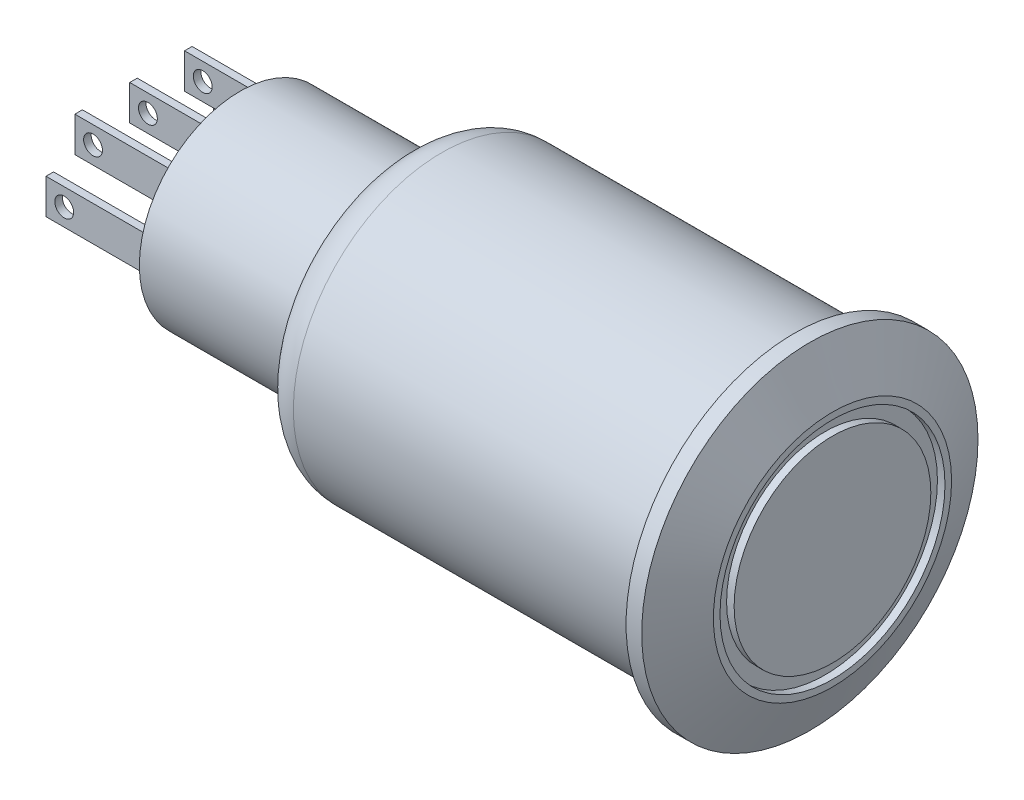
ISO-10303-21;
HEADER;
FILE_DESCRIPTION(('STEP AP214'),'2;1');
FILE_NAME('part.step','',(''),(''),'','','');
FILE_SCHEMA(('AUTOMOTIVE_DESIGN { 1 0 10303 214 1 1 1 1 }'));
ENDSEC;
DATA;
#1=APPLICATION_CONTEXT('core data for automotive mechanical design processes');
#2=APPLICATION_PROTOCOL_DEFINITION('international standard','automotive_design',2000,#1);
#3=PRODUCT_CONTEXT('',#1,'mechanical');
#4=PRODUCT('Part','Part','',(#3));
#5=PRODUCT_RELATED_PRODUCT_CATEGORY('part','',(#4));
#6=PRODUCT_DEFINITION_FORMATION('','',#4);
#7=PRODUCT_DEFINITION_CONTEXT('part definition',#1,'design');
#8=PRODUCT_DEFINITION('design','',#6,#7);
#9=PRODUCT_DEFINITION_SHAPE('','',#8);
#10=(LENGTH_UNIT() NAMED_UNIT(*) SI_UNIT(.MILLI.,.METRE.));
#11=(NAMED_UNIT(*) PLANE_ANGLE_UNIT() SI_UNIT($,.RADIAN.));
#12=(NAMED_UNIT(*) SI_UNIT($,.STERADIAN.) SOLID_ANGLE_UNIT());
#13=UNCERTAINTY_MEASURE_WITH_UNIT(LENGTH_MEASURE(1.E-05),#10,'distance_accuracy_value','');
#14=(GEOMETRIC_REPRESENTATION_CONTEXT(3) GLOBAL_UNCERTAINTY_ASSIGNED_CONTEXT((#13)) GLOBAL_UNIT_ASSIGNED_CONTEXT((#10,
#11,#12)) REPRESENTATION_CONTEXT('',''));
#15=CARTESIAN_POINT('',(0.,0.,0.));
#16=DIRECTION('',(0.,0.,1.));
#17=DIRECTION('',(1.,0.,0.));
#18=AXIS2_PLACEMENT_3D('',#15,#16,#17);
#19=CARTESIAN_POINT('',(-8.7,0.,0.));
#20=DIRECTION('',(-1.,0.,0.));
#21=DIRECTION('',(0.,0.,1.));
#22=AXIS2_PLACEMENT_3D('',#19,#20,#21);
#23=PLANE('',#22);
#24=CARTESIAN_POINT('',(-8.7,0.,0.));
#25=DIRECTION('',(-1.,0.,0.));
#26=DIRECTION('',(0.,0.,1.));
#27=AXIS2_PLACEMENT_3D('',#24,#25,#26);
#28=CIRCLE('',#27,5.34);
#29=CARTESIAN_POINT('',(-8.7,0.,5.34));
#30=VERTEX_POINT('',#29);
#31=EDGE_CURVE('E314',#30,#30,#28,.T.);
#32=ORIENTED_EDGE('',*,*,#31,.T.);
#33=EDGE_LOOP('',(#32));
#34=FACE_BOUND('',#33,.T.);
#35=DIRECTION('',(0.,0.,-1.));
#36=VECTOR('',#35,1.);
#37=CARTESIAN_POINT('',(-8.7,3.01596308984255,-3.10816810993934));
#38=LINE('',#37,#36);
#39=CARTESIAN_POINT('',(-8.7,3.01596308984255,-2.70816810993934));
#40=VERTEX_POINT('',#39);
#41=CARTESIAN_POINT('',(-8.7,3.01596308984255,-3.10816810993934));
#42=VERTEX_POINT('',#41);
#43=EDGE_CURVE('E299',#40,#42,#38,.T.);
#44=ORIENTED_EDGE('',*,*,#43,.F.);
#45=DIRECTION('',(0.,1.,0.));
#46=VECTOR('',#45,1.);
#47=CARTESIAN_POINT('',(-8.7,3.01596308984255,-2.70816810993934));
#48=LINE('',#47,#46);
#49=CARTESIAN_POINT('',(-8.7,1.15596308984255,-2.70816810993934));
#50=VERTEX_POINT('',#49);
#51=EDGE_CURVE('E285',#50,#40,#48,.T.);
#52=ORIENTED_EDGE('',*,*,#51,.F.);
#53=DIRECTION('',(0.,0.,1.));
#54=VECTOR('',#53,1.);
#55=CARTESIAN_POINT('',(-8.7,1.15596308984255,-3.10816810993934));
#56=LINE('',#55,#54);
#57=CARTESIAN_POINT('',(-8.7,1.15596308984255,-3.10816810993934));
#58=VERTEX_POINT('',#57);
#59=EDGE_CURVE('E290',#58,#50,#56,.T.);
#60=ORIENTED_EDGE('',*,*,#59,.F.);
#61=DIRECTION('',(0.,-1.,0.));
#62=VECTOR('',#61,1.);
#63=CARTESIAN_POINT('',(-8.7,3.01596308984255,-3.10816810993934));
#64=LINE('',#63,#62);
#65=EDGE_CURVE('E301',#42,#58,#64,.T.);
#66=ORIENTED_EDGE('',*,*,#65,.F.);
#67=EDGE_LOOP('',(#44,#52,#60,#66));
#68=FACE_BOUND('',#67,.T.);
#69=DIRECTION('',(0.,0.,1.));
#70=VECTOR('',#69,1.);
#71=CARTESIAN_POINT('',(-8.7,1.15596308984255,0.2));
#72=LINE('',#71,#70);
#73=CARTESIAN_POINT('',(-8.7,1.15596308984255,-0.2));
#74=VERTEX_POINT('',#73);
#75=CARTESIAN_POINT('',(-8.7,1.15596308984255,0.2));
#76=VERTEX_POINT('',#75);
#77=EDGE_CURVE('E270',#74,#76,#72,.T.);
#78=ORIENTED_EDGE('',*,*,#77,.F.);
#79=DIRECTION('',(0.,-1.,0.));
#80=VECTOR('',#79,1.);
#81=CARTESIAN_POINT('',(-8.7,1.15596308984255,-0.2));
#82=LINE('',#81,#80);
#83=CARTESIAN_POINT('',(-8.7,3.01596308984255,-0.2));
#84=VERTEX_POINT('',#83);
#85=EDGE_CURVE('E256',#84,#74,#82,.T.);
#86=ORIENTED_EDGE('',*,*,#85,.F.);
#87=DIRECTION('',(0.,0.,-1.));
#88=VECTOR('',#87,1.);
#89=CARTESIAN_POINT('',(-8.7,3.01596308984255,0.2));
#90=LINE('',#89,#88);
#91=CARTESIAN_POINT('',(-8.7,3.01596308984255,0.2));
#92=VERTEX_POINT('',#91);
#93=EDGE_CURVE('E261',#92,#84,#90,.T.);
#94=ORIENTED_EDGE('',*,*,#93,.F.);
#95=DIRECTION('',(0.,1.,0.));
#96=VECTOR('',#95,1.);
#97=CARTESIAN_POINT('',(-8.7,1.15596308984255,0.2));
#98=LINE('',#97,#96);
#99=EDGE_CURVE('E272',#76,#92,#98,.T.);
#100=ORIENTED_EDGE('',*,*,#99,.F.);
#101=EDGE_LOOP('',(#78,#86,#94,#100));
#102=FACE_BOUND('',#101,.T.);
#103=DIRECTION('',(0.,0.,-1.));
#104=VECTOR('',#103,1.);
#105=CARTESIAN_POINT('',(-8.7,3.01596308984255,3.10816810993934));
#106=LINE('',#105,#104);
#107=CARTESIAN_POINT('',(-8.7,3.01596308984255,3.10816810993934));
#108=VERTEX_POINT('',#107);
#109=CARTESIAN_POINT('',(-8.7,3.01596308984255,2.70816810993934));
#110=VERTEX_POINT('',#109);
#111=EDGE_CURVE('E241',#108,#110,#106,.T.);
#112=ORIENTED_EDGE('',*,*,#111,.F.);
#113=DIRECTION('',(0.,1.,0.));
#114=VECTOR('',#113,1.);
#115=CARTESIAN_POINT('',(-8.7,3.01596308984255,3.10816810993934));
#116=LINE('',#115,#114);
#117=CARTESIAN_POINT('',(-8.7,1.15596308984255,3.10816810993934));
#118=VERTEX_POINT('',#117);
#119=EDGE_CURVE('E227',#118,#108,#116,.T.);
#120=ORIENTED_EDGE('',*,*,#119,.F.);
#121=DIRECTION('',(0.,0.,1.));
#122=VECTOR('',#121,1.);
#123=CARTESIAN_POINT('',(-8.7,1.15596308984255,3.10816810993934));
#124=LINE('',#123,#122);
#125=CARTESIAN_POINT('',(-8.7,1.15596308984255,2.70816810993934));
#126=VERTEX_POINT('',#125);
#127=EDGE_CURVE('E232',#126,#118,#124,.T.);
#128=ORIENTED_EDGE('',*,*,#127,.F.);
#129=DIRECTION('',(0.,-1.,0.));
#130=VECTOR('',#129,1.);
#131=CARTESIAN_POINT('',(-8.7,3.01596308984255,2.70816810993934));
#132=LINE('',#131,#130);
#133=EDGE_CURVE('E243',#110,#126,#132,.T.);
#134=ORIENTED_EDGE('',*,*,#133,.F.);
#135=EDGE_LOOP('',(#112,#120,#128,#134));
#136=FACE_BOUND('',#135,.T.);
#137=DIRECTION('',(0.,0.,-1.));
#138=VECTOR('',#137,1.);
#139=CARTESIAN_POINT('',(-8.7,0.930000000000001,-4.63786569712756));
#140=LINE('',#139,#138);
#141=CARTESIAN_POINT('',(-8.7,0.930000000000001,-4.23786569712756));
#142=VERTEX_POINT('',#141);
#143=CARTESIAN_POINT('',(-8.7,0.930000000000001,-4.63786569712756));
#144=VERTEX_POINT('',#143);
#145=EDGE_CURVE('E199',#142,#144,#140,.T.);
#146=ORIENTED_EDGE('',*,*,#145,.F.);
#147=DIRECTION('',(0.,1.,0.));
#148=VECTOR('',#147,1.);
#149=CARTESIAN_POINT('',(-8.7,0.930000000000001,-4.23786569712756));
#150=LINE('',#149,#148);
#151=CARTESIAN_POINT('',(-8.7,-0.929999999999999,-4.23786569712756));
#152=VERTEX_POINT('',#151);
#153=EDGE_CURVE('E196',#152,#142,#150,.T.);
#154=ORIENTED_EDGE('',*,*,#153,.F.);
#155=DIRECTION('',(0.,0.,1.));
#156=VECTOR('',#155,1.);
#157=CARTESIAN_POINT('',(-8.7,-0.929999999999999,-4.63786569712756));
#158=LINE('',#157,#156);
#159=CARTESIAN_POINT('',(-8.7,-0.929999999999999,-4.63786569712756));
#160=VERTEX_POINT('',#159);
#161=EDGE_CURVE('E208',#160,#152,#158,.T.);
#162=ORIENTED_EDGE('',*,*,#161,.F.);
#163=DIRECTION('',(0.,-1.,0.));
#164=VECTOR('',#163,1.);
#165=CARTESIAN_POINT('',(-8.7,0.930000000000001,-4.63786569712756));
#166=LINE('',#165,#164);
#167=EDGE_CURVE('E216',#144,#160,#166,.T.);
#168=ORIENTED_EDGE('',*,*,#167,.F.);
#169=EDGE_LOOP('',(#146,#154,#162,#168));
#170=FACE_BOUND('',#169,.T.);
#171=DIRECTION('',(0.,0.,-1.));
#172=VECTOR('',#171,1.);
#173=CARTESIAN_POINT('',(-8.7,0.930000000000001,4.63786569712756));
#174=LINE('',#173,#172);
#175=CARTESIAN_POINT('',(-8.7,0.930000000000001,4.63786569712756));
#176=VERTEX_POINT('',#175);
#177=CARTESIAN_POINT('',(-8.7,0.930000000000001,4.23786569712756));
#178=VERTEX_POINT('',#177);
#179=EDGE_CURVE('E809',#176,#178,#174,.T.);
#180=ORIENTED_EDGE('',*,*,#179,.F.);
#181=DIRECTION('',(0.,1.,0.));
#182=VECTOR('',#181,1.);
#183=CARTESIAN_POINT('',(-8.7,0.930000000000001,4.63786569712756));
#184=LINE('',#183,#182);
#185=CARTESIAN_POINT('',(-8.7,-0.929999999999999,4.63786569712756));
#186=VERTEX_POINT('',#185);
#187=EDGE_CURVE('E194',#186,#176,#184,.T.);
#188=ORIENTED_EDGE('',*,*,#187,.F.);
#189=DIRECTION('',(0.,0.,1.));
#190=VECTOR('',#189,1.);
#191=CARTESIAN_POINT('',(-8.7,-0.929999999999999,4.63786569712756));
#192=LINE('',#191,#190);
#193=CARTESIAN_POINT('',(-8.7,-0.929999999999999,4.23786569712756));
#194=VERTEX_POINT('',#193);
#195=EDGE_CURVE('E190',#194,#186,#192,.T.);
#196=ORIENTED_EDGE('',*,*,#195,.F.);
#197=DIRECTION('',(0.,-1.,0.));
#198=VECTOR('',#197,1.);
#199=CARTESIAN_POINT('',(-8.7,0.930000000000001,4.23786569712756));
#200=LINE('',#199,#198);
#201=EDGE_CURVE('E811',#178,#194,#200,.T.);
#202=ORIENTED_EDGE('',*,*,#201,.F.);
#203=EDGE_LOOP('',(#180,#188,#196,#202));
#204=FACE_BOUND('',#203,.T.);
#205=ADVANCED_FACE('F33',(#34,#68,#102,#136,#170,#204),#23,.T.);
#206=CARTESIAN_POINT('',(20.68,0.,0.));
#207=DIRECTION('',(-1.,0.,0.));
#208=DIRECTION('',(0.,0.,1.));
#209=AXIS2_PLACEMENT_3D('',#206,#207,#208);
#210=CYLINDRICAL_SURFACE('',#209,7.875);
#211=CARTESIAN_POINT('',(2.,0.,0.));
#212=DIRECTION('',(1.,0.,0.));
#213=DIRECTION('',(0.,0.,-1.));
#214=AXIS2_PLACEMENT_3D('',#211,#212,#213);
#215=CIRCLE('',#214,7.875);
#216=CARTESIAN_POINT('',(2.,0.,-7.875));
#217=VERTEX_POINT('',#216);
#218=EDGE_CURVE('E41',#217,#217,#215,.T.);
#219=ORIENTED_EDGE('',*,*,#218,.T.);
#220=EDGE_LOOP('',(#219));
#221=FACE_BOUND('',#220,.T.);
#222=CARTESIAN_POINT('',(20.68,0.,0.));
#223=DIRECTION('',(1.,0.,0.));
#224=DIRECTION('',(0.,0.,-1.));
#225=AXIS2_PLACEMENT_3D('',#222,#223,#224);
#226=CIRCLE('',#225,7.875);
#227=CARTESIAN_POINT('',(20.68,0.,-7.875));
#228=VERTEX_POINT('',#227);
#229=EDGE_CURVE('E336',#228,#228,#226,.T.);
#230=ORIENTED_EDGE('',*,*,#229,.F.);
#231=EDGE_LOOP('',(#230));
#232=FACE_BOUND('',#231,.T.);
#233=ADVANCED_FACE('F356',(#221,#232),#210,.T.);
#234=CARTESIAN_POINT('',(0.,0.,0.));
#235=DIRECTION('',(1.,0.,0.));
#236=DIRECTION('',(0.,0.,-1.));
#237=AXIS2_PLACEMENT_3D('',#234,#235,#236);
#238=PLANE('',#237);
#239=CARTESIAN_POINT('',(0.,0.,0.));
#240=DIRECTION('',(1.,0.,0.));
#241=DIRECTION('',(0.,0.,-1.));
#242=AXIS2_PLACEMENT_3D('',#239,#240,#241);
#243=CIRCLE('',#242,5.875);
#244=CARTESIAN_POINT('',(0.,0.,-5.875));
#245=VERTEX_POINT('',#244);
#246=EDGE_CURVE('E11',#245,#245,#243,.F.);
#247=ORIENTED_EDGE('',*,*,#246,.T.);
#248=EDGE_LOOP('',(#247));
#249=FACE_BOUND('',#248,.T.);
#250=CARTESIAN_POINT('',(0.,0.,0.));
#251=DIRECTION('',(-1.,0.,0.));
#252=DIRECTION('',(0.,0.,1.));
#253=AXIS2_PLACEMENT_3D('',#250,#251,#252);
#254=CIRCLE('',#253,5.34);
#255=CARTESIAN_POINT('',(0.,0.,5.34));
#256=VERTEX_POINT('',#255);
#257=EDGE_CURVE('E318',#256,#256,#254,.T.);
#258=ORIENTED_EDGE('',*,*,#257,.F.);
#259=EDGE_LOOP('',(#258));
#260=FACE_BOUND('',#259,.T.);
#261=ADVANCED_FACE('F376',(#249,#260),#238,.F.);
#262=CARTESIAN_POINT('',(22.71,0.,0.));
#263=DIRECTION('',(-1.,0.,0.));
#264=DIRECTION('',(0.,0.,1.));
#265=AXIS2_PLACEMENT_3D('',#262,#263,#264);
#266=CYLINDRICAL_SURFACE('',#265,8.915);
#267=CARTESIAN_POINT('',(21.51,0.,0.));
#268=DIRECTION('',(1.,0.,0.));
#269=DIRECTION('',(0.,0.,-1.));
#270=AXIS2_PLACEMENT_3D('',#267,#268,#269);
#271=CIRCLE('',#270,8.915);
#272=CARTESIAN_POINT('',(21.51,0.,-8.915));
#273=VERTEX_POINT('',#272);
#274=EDGE_CURVE('E321',#273,#273,#271,.F.);
#275=ORIENTED_EDGE('',*,*,#274,.T.);
#276=EDGE_LOOP('',(#275));
#277=FACE_BOUND('',#276,.T.);
#278=CARTESIAN_POINT('',(20.68,0.,0.));
#279=DIRECTION('',(1.,0.,0.));
#280=DIRECTION('',(0.,0.,-1.));
#281=AXIS2_PLACEMENT_3D('',#278,#279,#280);
#282=CIRCLE('',#281,8.915);
#283=CARTESIAN_POINT('',(20.68,0.,-8.915));
#284=VERTEX_POINT('',#283);
#285=EDGE_CURVE('E331',#284,#284,#282,.T.);
#286=ORIENTED_EDGE('',*,*,#285,.T.);
#287=EDGE_LOOP('',(#286));
#288=FACE_BOUND('',#287,.T.);
#289=ADVANCED_FACE('F405',(#277,#288),#266,.T.);
#290=CARTESIAN_POINT('',(22.71,0.,0.));
#291=DIRECTION('',(1.,0.,0.));
#292=DIRECTION('',(0.,0.,-1.));
#293=AXIS2_PLACEMENT_3D('',#290,#291,#292);
#294=PLANE('',#293);
#295=CARTESIAN_POINT('',(22.71,0.,0.));
#296=DIRECTION('',(1.,0.,0.));
#297=DIRECTION('',(0.,0.,-1.));
#298=AXIS2_PLACEMENT_3D('',#295,#296,#297);
#299=CIRCLE('',#298,6.31499999999998);
#300=CARTESIAN_POINT('',(22.71,0.,-6.31499999999998));
#301=VERTEX_POINT('',#300);
#302=EDGE_CURVE('E339',#301,#301,#299,.T.);
#303=ORIENTED_EDGE('',*,*,#302,.T.);
#304=EDGE_LOOP('',(#303));
#305=FACE_BOUND('',#304,.T.);
#306=CARTESIAN_POINT('',(22.71,0.,0.));
#307=DIRECTION('',(1.,0.,0.));
#308=DIRECTION('',(0.,0.,-1.));
#309=AXIS2_PLACEMENT_3D('',#306,#307,#308);
#310=CIRCLE('',#309,5.965);
#311=CARTESIAN_POINT('',(22.71,0.,-5.965));
#312=VERTEX_POINT('',#311);
#313=EDGE_CURVE('E325',#312,#312,#310,.T.);
#314=ORIENTED_EDGE('',*,*,#313,.F.);
#315=EDGE_LOOP('',(#314));
#316=FACE_BOUND('',#315,.T.);
#317=ADVANCED_FACE('F402',(#305,#316),#294,.T.);
#318=CARTESIAN_POINT('',(20.68,0.,0.));
#319=DIRECTION('',(1.,0.,0.));
#320=DIRECTION('',(0.,0.,-1.));
#321=AXIS2_PLACEMENT_3D('',#318,#319,#320);
#322=PLANE('',#321);
#323=ORIENTED_EDGE('',*,*,#229,.T.);
#324=EDGE_LOOP('',(#323));
#325=FACE_BOUND('',#324,.T.);
#326=ORIENTED_EDGE('',*,*,#285,.F.);
#327=EDGE_LOOP('',(#326));
#328=FACE_BOUND('',#327,.T.);
#329=ADVANCED_FACE('F400',(#325,#328),#322,.F.);
#330=CARTESIAN_POINT('',(22.31,0.,0.));
#331=DIRECTION('',(1.,0.,0.));
#332=DIRECTION('',(0.,0.,-1.));
#333=AXIS2_PLACEMENT_3D('',#330,#331,#332);
#334=CYLINDRICAL_SURFACE('',#333,5.965);
#335=CARTESIAN_POINT('',(22.31,0.,0.));
#336=DIRECTION('',(1.,0.,0.));
#337=DIRECTION('',(0.,0.,-1.));
#338=AXIS2_PLACEMENT_3D('',#335,#336,#337);
#339=CIRCLE('',#338,5.965);
#340=CARTESIAN_POINT('',(22.31,0.,-5.965));
#341=VERTEX_POINT('',#340);
#342=EDGE_CURVE('E328',#341,#341,#339,.T.);
#343=ORIENTED_EDGE('',*,*,#342,.F.);
#344=EDGE_LOOP('',(#343));
#345=FACE_BOUND('',#344,.T.);
#346=ORIENTED_EDGE('',*,*,#313,.T.);
#347=EDGE_LOOP('',(#346));
#348=FACE_BOUND('',#347,.T.);
#349=ADVANCED_FACE('F396',(#345,#348),#334,.F.);
#350=CARTESIAN_POINT('',(22.31,0.,0.));
#351=DIRECTION('',(1.,0.,0.));
#352=DIRECTION('',(0.,0.,-1.));
#353=AXIS2_PLACEMENT_3D('',#350,#351,#352);
#354=PLANE('',#353);
#355=CARTESIAN_POINT('',(22.31,0.,0.));
#356=DIRECTION('',(1.,0.,0.));
#357=DIRECTION('',(0.,0.,-1.));
#358=AXIS2_PLACEMENT_3D('',#355,#356,#357);
#359=CIRCLE('',#358,5.215);
#360=CARTESIAN_POINT('',(22.31,0.,-5.215));
#361=VERTEX_POINT('',#360);
#362=EDGE_CURVE('E322',#361,#361,#359,.T.);
#363=ORIENTED_EDGE('',*,*,#362,.F.);
#364=EDGE_LOOP('',(#363));
#365=FACE_BOUND('',#364,.T.);
#366=ORIENTED_EDGE('',*,*,#342,.T.);
#367=EDGE_LOOP('',(#366));
#368=FACE_BOUND('',#367,.T.);
#369=ADVANCED_FACE('F392',(#365,#368),#354,.T.);
#370=CARTESIAN_POINT('',(22.31,0.,0.));
#371=DIRECTION('',(1.,0.,0.));
#372=DIRECTION('',(0.,0.,-1.));
#373=AXIS2_PLACEMENT_3D('',#370,#371,#372);
#374=CYLINDRICAL_SURFACE('',#373,5.215);
#375=ORIENTED_EDGE('',*,*,#362,.T.);
#376=EDGE_LOOP('',(#375));
#377=FACE_BOUND('',#376,.T.);
#378=CARTESIAN_POINT('',(22.71,0.,0.));
#379=DIRECTION('',(1.,0.,0.));
#380=DIRECTION('',(0.,0.,-1.));
#381=AXIS2_PLACEMENT_3D('',#378,#379,#380);
#382=CIRCLE('',#381,5.215);
#383=CARTESIAN_POINT('',(22.71,0.,-5.215));
#384=VERTEX_POINT('',#383);
#385=EDGE_CURVE('E317',#384,#384,#382,.T.);
#386=ORIENTED_EDGE('',*,*,#385,.F.);
#387=EDGE_LOOP('',(#386));
#388=FACE_BOUND('',#387,.T.);
#389=ADVANCED_FACE('F388',(#377,#388),#374,.T.);
#390=ORIENTED_EDGE('',*,*,#385,.T.);
#391=EDGE_LOOP('',(#390));
#392=FACE_BOUND('',#391,.T.);
#393=ADVANCED_FACE('F391',(#392),#294,.T.);
#394=CARTESIAN_POINT('',(22.71,0.,0.));
#395=DIRECTION('',(-1.,0.,0.));
#396=DIRECTION('',(0.,0.,1.));
#397=AXIS2_PLACEMENT_3D('',#394,#395,#396);
#398=CONICAL_SURFACE('',#397,6.31499999999998,1.13838855122436);
#399=ORIENTED_EDGE('',*,*,#274,.F.);
#400=EDGE_LOOP('',(#399));
#401=FACE_BOUND('',#400,.T.);
#402=ORIENTED_EDGE('',*,*,#302,.F.);
#403=EDGE_LOOP('',(#402));
#404=FACE_BOUND('',#403,.T.);
#405=ADVANCED_FACE('F386',(#401,#404),#398,.T.);
#406=CARTESIAN_POINT('',(-8.7,0.,0.));
#407=DIRECTION('',(1.,0.,0.));
#408=DIRECTION('',(0.,0.,-1.));
#409=AXIS2_PLACEMENT_3D('',#406,#407,#408);
#410=CYLINDRICAL_SURFACE('',#409,5.34);
#411=ORIENTED_EDGE('',*,*,#31,.F.);
#412=EDGE_LOOP('',(#411));
#413=FACE_BOUND('',#412,.T.);
#414=ORIENTED_EDGE('',*,*,#257,.T.);
#415=EDGE_LOOP('',(#414));
#416=FACE_BOUND('',#415,.T.);
#417=ADVANCED_FACE('F383',(#413,#416),#410,.T.);
#418=CARTESIAN_POINT('',(-14.35,3.01596308984255,-2.70816810993934));
#419=DIRECTION('',(0.,0.,-1.));
#420=DIRECTION('',(-1.,0.,0.));
#421=AXIS2_PLACEMENT_3D('',#418,#419,#420);
#422=PLANE('',#421);
#423=CARTESIAN_POINT('',(-13.3850326733525,2.08596308984255,-2.70816810993934));
#424=DIRECTION('',(0.,0.,-1.));
#425=DIRECTION('',(-1.,0.,0.));
#426=AXIS2_PLACEMENT_3D('',#423,#424,#425);
#427=CIRCLE('',#426,0.500000000000001);
#428=CARTESIAN_POINT('',(-13.8850326733525,2.08596308984255,-2.70816810993934));
#429=VERTEX_POINT('',#428);
#430=EDGE_CURVE('E814',#429,#429,#427,.T.);
#431=ORIENTED_EDGE('',*,*,#430,.T.);
#432=EDGE_LOOP('',(#431));
#433=FACE_BOUND('',#432,.T.);
#434=ORIENTED_EDGE('',*,*,#51,.T.);
#435=DIRECTION('',(1.,0.,0.));
#436=VECTOR('',#435,1.);
#437=CARTESIAN_POINT('',(-14.35,3.01596308984255,-2.70816810993934));
#438=LINE('',#437,#436);
#439=CARTESIAN_POINT('',(-14.35,3.01596308984255,-2.70816810993934));
#440=VERTEX_POINT('',#439);
#441=EDGE_CURVE('E312',#440,#40,#438,.T.);
#442=ORIENTED_EDGE('',*,*,#441,.F.);
#443=DIRECTION('',(0.,1.,0.));
#444=VECTOR('',#443,1.);
#445=CARTESIAN_POINT('',(-14.35,3.01596308984255,-2.70816810993934));
#446=LINE('',#445,#444);
#447=CARTESIAN_POINT('',(-14.35,1.15596308984255,-2.70816810993934));
#448=VERTEX_POINT('',#447);
#449=EDGE_CURVE('E286',#448,#440,#446,.T.);
#450=ORIENTED_EDGE('',*,*,#449,.F.);
#451=DIRECTION('',(1.,0.,0.));
#452=VECTOR('',#451,1.);
#453=CARTESIAN_POINT('',(-14.35,1.15596308984255,-2.70816810993934));
#454=LINE('',#453,#452);
#455=EDGE_CURVE('E296',#448,#50,#454,.T.);
#456=ORIENTED_EDGE('',*,*,#455,.T.);
#457=EDGE_LOOP('',(#434,#442,#450,#456));
#458=FACE_BOUND('',#457,.T.);
#459=ADVANCED_FACE('F381',(#433,#458),#422,.F.);
#460=CARTESIAN_POINT('',(-14.35,3.01596308984255,-3.10816810993934));
#461=DIRECTION('',(0.,-1.,0.));
#462=DIRECTION('',(0.,0.,-1.));
#463=AXIS2_PLACEMENT_3D('',#460,#461,#462);
#464=PLANE('',#463);
#465=ORIENTED_EDGE('',*,*,#43,.T.);
#466=DIRECTION('',(1.,0.,0.));
#467=VECTOR('',#466,1.);
#468=CARTESIAN_POINT('',(-14.35,3.01596308984255,-3.10816810993934));
#469=LINE('',#468,#467);
#470=CARTESIAN_POINT('',(-14.35,3.01596308984255,-3.10816810993934));
#471=VERTEX_POINT('',#470);
#472=EDGE_CURVE('E309',#471,#42,#469,.T.);
#473=ORIENTED_EDGE('',*,*,#472,.F.);
#474=DIRECTION('',(0.,0.,-1.));
#475=VECTOR('',#474,1.);
#476=CARTESIAN_POINT('',(-14.35,3.01596308984255,-3.10816810993934));
#477=LINE('',#476,#475);
#478=EDGE_CURVE('E289',#440,#471,#477,.T.);
#479=ORIENTED_EDGE('',*,*,#478,.F.);
#480=ORIENTED_EDGE('',*,*,#441,.T.);
#481=EDGE_LOOP('',(#465,#473,#479,#480));
#482=FACE_BOUND('',#481,.T.);
#483=ADVANCED_FACE('F635',(#482),#464,.F.);
#484=CARTESIAN_POINT('',(-14.35,3.01596308984255,-3.10816810993934));
#485=DIRECTION('',(0.,0.,1.));
#486=DIRECTION('',(0.,-1.,0.));
#487=AXIS2_PLACEMENT_3D('',#484,#485,#486);
#488=PLANE('',#487);
#489=CARTESIAN_POINT('',(-13.3850326733525,2.08596308984255,-3.10816810993934));
#490=DIRECTION('',(0.,0.,1.));
#491=DIRECTION('',(0.,-1.,0.));
#492=AXIS2_PLACEMENT_3D('',#489,#490,#491);
#493=CIRCLE('',#492,0.500000000000001);
#494=CARTESIAN_POINT('',(-13.3850326733525,1.58596308984255,-3.10816810993934));
#495=VERTEX_POINT('',#494);
#496=EDGE_CURVE('E824',#495,#495,#493,.T.);
#497=ORIENTED_EDGE('',*,*,#496,.T.);
#498=EDGE_LOOP('',(#497));
#499=FACE_BOUND('',#498,.T.);
#500=ORIENTED_EDGE('',*,*,#65,.T.);
#501=DIRECTION('',(1.,0.,0.));
#502=VECTOR('',#501,1.);
#503=CARTESIAN_POINT('',(-14.35,1.15596308984255,-3.10816810993934));
#504=LINE('',#503,#502);
#505=CARTESIAN_POINT('',(-14.35,1.15596308984255,-3.10816810993934));
#506=VERTEX_POINT('',#505);
#507=EDGE_CURVE('E307',#506,#58,#504,.T.);
#508=ORIENTED_EDGE('',*,*,#507,.F.);
#509=DIRECTION('',(0.,-1.,0.));
#510=VECTOR('',#509,1.);
#511=CARTESIAN_POINT('',(-14.35,3.01596308984255,-3.10816810993934));
#512=LINE('',#511,#510);
#513=EDGE_CURVE('E292',#471,#506,#512,.T.);
#514=ORIENTED_EDGE('',*,*,#513,.F.);
#515=ORIENTED_EDGE('',*,*,#472,.T.);
#516=EDGE_LOOP('',(#500,#508,#514,#515));
#517=FACE_BOUND('',#516,.T.);
#518=ADVANCED_FACE('F629',(#499,#517),#488,.F.);
#519=CARTESIAN_POINT('',(-14.35,1.15596308984255,-3.10816810993934));
#520=DIRECTION('',(0.,1.,0.));
#521=DIRECTION('',(0.,0.,1.));
#522=AXIS2_PLACEMENT_3D('',#519,#520,#521);
#523=PLANE('',#522);
#524=ORIENTED_EDGE('',*,*,#59,.T.);
#525=ORIENTED_EDGE('',*,*,#455,.F.);
#526=DIRECTION('',(0.,0.,1.));
#527=VECTOR('',#526,1.);
#528=CARTESIAN_POINT('',(-14.35,1.15596308984255,-3.10816810993934));
#529=LINE('',#528,#527);
#530=EDGE_CURVE('E294',#506,#448,#529,.T.);
#531=ORIENTED_EDGE('',*,*,#530,.F.);
#532=ORIENTED_EDGE('',*,*,#507,.T.);
#533=EDGE_LOOP('',(#524,#525,#531,#532));
#534=FACE_BOUND('',#533,.T.);
#535=ADVANCED_FACE('F634',(#534),#523,.F.);
#536=CARTESIAN_POINT('',(-14.35,0.,0.));
#537=DIRECTION('',(-1.,0.,0.));
#538=DIRECTION('',(0.,0.,1.));
#539=AXIS2_PLACEMENT_3D('',#536,#537,#538);
#540=PLANE('',#539);
#541=ORIENTED_EDGE('',*,*,#449,.T.);
#542=ORIENTED_EDGE('',*,*,#478,.T.);
#543=ORIENTED_EDGE('',*,*,#513,.T.);
#544=ORIENTED_EDGE('',*,*,#530,.T.);
#545=EDGE_LOOP('',(#541,#542,#543,#544));
#546=FACE_BOUND('',#545,.T.);
#547=ADVANCED_FACE('F621',(#546),#540,.T.);
#548=CARTESIAN_POINT('',(-14.35,1.15596308984255,-0.2));
#549=DIRECTION('',(0.,0.,1.));
#550=DIRECTION('',(1.,0.,0.));
#551=AXIS2_PLACEMENT_3D('',#548,#549,#550);
#552=PLANE('',#551);
#553=CARTESIAN_POINT('',(-13.3850326733525,2.08596308984255,-0.199999999999999));
#554=DIRECTION('',(0.,0.,1.));
#555=DIRECTION('',(1.,0.,0.));
#556=AXIS2_PLACEMENT_3D('',#553,#554,#555);
#557=CIRCLE('',#556,0.500000000000001);
#558=CARTESIAN_POINT('',(-12.8850326733525,2.08596308984255,-0.199999999999999));
#559=VERTEX_POINT('',#558);
#560=EDGE_CURVE('E827',#559,#559,#557,.T.);
#561=ORIENTED_EDGE('',*,*,#560,.T.);
#562=EDGE_LOOP('',(#561));
#563=FACE_BOUND('',#562,.T.);
#564=ORIENTED_EDGE('',*,*,#85,.T.);
#565=DIRECTION('',(1.,0.,0.));
#566=VECTOR('',#565,1.);
#567=CARTESIAN_POINT('',(-14.35,1.15596308984255,-0.2));
#568=LINE('',#567,#566);
#569=CARTESIAN_POINT('',(-14.35,1.15596308984255,-0.2));
#570=VERTEX_POINT('',#569);
#571=EDGE_CURVE('E283',#570,#74,#568,.T.);
#572=ORIENTED_EDGE('',*,*,#571,.F.);
#573=DIRECTION('',(0.,-1.,0.));
#574=VECTOR('',#573,1.);
#575=CARTESIAN_POINT('',(-14.35,1.15596308984255,-0.2));
#576=LINE('',#575,#574);
#577=CARTESIAN_POINT('',(-14.35,3.01596308984255,-0.2));
#578=VERTEX_POINT('',#577);
#579=EDGE_CURVE('E257',#578,#570,#576,.T.);
#580=ORIENTED_EDGE('',*,*,#579,.F.);
#581=DIRECTION('',(1.,0.,0.));
#582=VECTOR('',#581,1.);
#583=CARTESIAN_POINT('',(-14.35,3.01596308984255,-0.2));
#584=LINE('',#583,#582);
#585=EDGE_CURVE('E267',#578,#84,#584,.T.);
#586=ORIENTED_EDGE('',*,*,#585,.T.);
#587=EDGE_LOOP('',(#564,#572,#580,#586));
#588=FACE_BOUND('',#587,.T.);
#589=ADVANCED_FACE('F616',(#563,#588),#552,.F.);
#590=CARTESIAN_POINT('',(-14.35,1.15596308984255,0.2));
#591=DIRECTION('',(0.,1.,0.));
#592=DIRECTION('',(0.,0.,1.));
#593=AXIS2_PLACEMENT_3D('',#590,#591,#592);
#594=PLANE('',#593);
#595=ORIENTED_EDGE('',*,*,#77,.T.);
#596=DIRECTION('',(1.,0.,0.));
#597=VECTOR('',#596,1.);
#598=CARTESIAN_POINT('',(-14.35,1.15596308984255,0.2));
#599=LINE('',#598,#597);
#600=CARTESIAN_POINT('',(-14.35,1.15596308984255,0.2));
#601=VERTEX_POINT('',#600);
#602=EDGE_CURVE('E280',#601,#76,#599,.T.);
#603=ORIENTED_EDGE('',*,*,#602,.F.);
#604=DIRECTION('',(0.,0.,1.));
#605=VECTOR('',#604,1.);
#606=CARTESIAN_POINT('',(-14.35,1.15596308984255,0.2));
#607=LINE('',#606,#605);
#608=EDGE_CURVE('E260',#570,#601,#607,.T.);
#609=ORIENTED_EDGE('',*,*,#608,.F.);
#610=ORIENTED_EDGE('',*,*,#571,.T.);
#611=EDGE_LOOP('',(#595,#603,#609,#610));
#612=FACE_BOUND('',#611,.T.);
#613=ADVANCED_FACE('F606',(#612),#594,.F.);
#614=CARTESIAN_POINT('',(-14.35,1.15596308984255,0.2));
#615=DIRECTION('',(0.,0.,-1.));
#616=DIRECTION('',(-1.,0.,0.));
#617=AXIS2_PLACEMENT_3D('',#614,#615,#616);
#618=PLANE('',#617);
#619=CARTESIAN_POINT('',(-13.3850326733525,2.08596308984255,0.200000000000002));
#620=DIRECTION('',(0.,0.,-1.));
#621=DIRECTION('',(-1.,0.,0.));
#622=AXIS2_PLACEMENT_3D('',#619,#620,#621);
#623=CIRCLE('',#622,0.500000000000001);
#624=CARTESIAN_POINT('',(-13.8850326733525,2.08596308984255,0.200000000000002));
#625=VERTEX_POINT('',#624);
#626=EDGE_CURVE('E830',#625,#625,#623,.T.);
#627=ORIENTED_EDGE('',*,*,#626,.T.);
#628=EDGE_LOOP('',(#627));
#629=FACE_BOUND('',#628,.T.);
#630=ORIENTED_EDGE('',*,*,#99,.T.);
#631=DIRECTION('',(1.,0.,0.));
#632=VECTOR('',#631,1.);
#633=CARTESIAN_POINT('',(-14.35,3.01596308984255,0.2));
#634=LINE('',#633,#632);
#635=CARTESIAN_POINT('',(-14.35,3.01596308984255,0.2));
#636=VERTEX_POINT('',#635);
#637=EDGE_CURVE('E278',#636,#92,#634,.T.);
#638=ORIENTED_EDGE('',*,*,#637,.F.);
#639=DIRECTION('',(0.,1.,0.));
#640=VECTOR('',#639,1.);
#641=CARTESIAN_POINT('',(-14.35,1.15596308984255,0.2));
#642=LINE('',#641,#640);
#643=EDGE_CURVE('E263',#601,#636,#642,.T.);
#644=ORIENTED_EDGE('',*,*,#643,.F.);
#645=ORIENTED_EDGE('',*,*,#602,.T.);
#646=EDGE_LOOP('',(#630,#638,#644,#645));
#647=FACE_BOUND('',#646,.T.);
#648=ADVANCED_FACE('F600',(#629,#647),#618,.F.);
#649=CARTESIAN_POINT('',(-14.35,3.01596308984255,0.2));
#650=DIRECTION('',(0.,-1.,0.));
#651=DIRECTION('',(0.,0.,-1.));
#652=AXIS2_PLACEMENT_3D('',#649,#650,#651);
#653=PLANE('',#652);
#654=ORIENTED_EDGE('',*,*,#93,.T.);
#655=ORIENTED_EDGE('',*,*,#585,.F.);
#656=DIRECTION('',(0.,0.,-1.));
#657=VECTOR('',#656,1.);
#658=CARTESIAN_POINT('',(-14.35,3.01596308984255,0.2));
#659=LINE('',#658,#657);
#660=EDGE_CURVE('E265',#636,#578,#659,.T.);
#661=ORIENTED_EDGE('',*,*,#660,.F.);
#662=ORIENTED_EDGE('',*,*,#637,.T.);
#663=EDGE_LOOP('',(#654,#655,#661,#662));
#664=FACE_BOUND('',#663,.T.);
#665=ADVANCED_FACE('F605',(#664),#653,.F.);
#666=CARTESIAN_POINT('',(-14.35,0.,0.));
#667=DIRECTION('',(-1.,0.,0.));
#668=DIRECTION('',(0.,0.,1.));
#669=AXIS2_PLACEMENT_3D('',#666,#667,#668);
#670=PLANE('',#669);
#671=ORIENTED_EDGE('',*,*,#579,.T.);
#672=ORIENTED_EDGE('',*,*,#608,.T.);
#673=ORIENTED_EDGE('',*,*,#643,.T.);
#674=ORIENTED_EDGE('',*,*,#660,.T.);
#675=EDGE_LOOP('',(#671,#672,#673,#674));
#676=FACE_BOUND('',#675,.T.);
#677=ADVANCED_FACE('F592',(#676),#670,.T.);
#678=CARTESIAN_POINT('',(-14.35,3.01596308984255,3.10816810993934));
#679=DIRECTION('',(0.,0.,-1.));
#680=DIRECTION('',(0.,1.,0.));
#681=AXIS2_PLACEMENT_3D('',#678,#679,#680);
#682=PLANE('',#681);
#683=CARTESIAN_POINT('',(-13.3850326733525,2.08596308984255,3.10816810993934));
#684=DIRECTION('',(0.,0.,-1.));
#685=DIRECTION('',(0.,1.,0.));
#686=AXIS2_PLACEMENT_3D('',#683,#684,#685);
#687=CIRCLE('',#686,0.500000000000001);
#688=CARTESIAN_POINT('',(-13.3850326733525,2.58596308984255,3.10816810993934));
#689=VERTEX_POINT('',#688);
#690=EDGE_CURVE('E351',#689,#689,#687,.T.);
#691=ORIENTED_EDGE('',*,*,#690,.T.);
#692=EDGE_LOOP('',(#691));
#693=FACE_BOUND('',#692,.T.);
#694=ORIENTED_EDGE('',*,*,#119,.T.);
#695=DIRECTION('',(1.,0.,0.));
#696=VECTOR('',#695,1.);
#697=CARTESIAN_POINT('',(-14.35,3.01596308984255,3.10816810993934));
#698=LINE('',#697,#696);
#699=CARTESIAN_POINT('',(-14.35,3.01596308984255,3.10816810993934));
#700=VERTEX_POINT('',#699);
#701=EDGE_CURVE('E254',#700,#108,#698,.T.);
#702=ORIENTED_EDGE('',*,*,#701,.F.);
#703=DIRECTION('',(0.,1.,0.));
#704=VECTOR('',#703,1.);
#705=CARTESIAN_POINT('',(-14.35,3.01596308984255,3.10816810993934));
#706=LINE('',#705,#704);
#707=CARTESIAN_POINT('',(-14.35,1.15596308984255,3.10816810993934));
#708=VERTEX_POINT('',#707);
#709=EDGE_CURVE('E228',#708,#700,#706,.T.);
#710=ORIENTED_EDGE('',*,*,#709,.F.);
#711=DIRECTION('',(1.,0.,0.));
#712=VECTOR('',#711,1.);
#713=CARTESIAN_POINT('',(-14.35,1.15596308984255,3.10816810993934));
#714=LINE('',#713,#712);
#715=EDGE_CURVE('E238',#708,#118,#714,.T.);
#716=ORIENTED_EDGE('',*,*,#715,.T.);
#717=EDGE_LOOP('',(#694,#702,#710,#716));
#718=FACE_BOUND('',#717,.T.);
#719=ADVANCED_FACE('F587',(#693,#718),#682,.F.);
#720=CARTESIAN_POINT('',(-14.35,3.01596308984255,3.10816810993934));
#721=DIRECTION('',(0.,-1.,0.));
#722=DIRECTION('',(0.,0.,-1.));
#723=AXIS2_PLACEMENT_3D('',#720,#721,#722);
#724=PLANE('',#723);
#725=ORIENTED_EDGE('',*,*,#111,.T.);
#726=DIRECTION('',(1.,0.,0.));
#727=VECTOR('',#726,1.);
#728=CARTESIAN_POINT('',(-14.35,3.01596308984255,2.70816810993934));
#729=LINE('',#728,#727);
#730=CARTESIAN_POINT('',(-14.35,3.01596308984255,2.70816810993934));
#731=VERTEX_POINT('',#730);
#732=EDGE_CURVE('E251',#731,#110,#729,.T.);
#733=ORIENTED_EDGE('',*,*,#732,.F.);
#734=DIRECTION('',(0.,0.,-1.));
#735=VECTOR('',#734,1.);
#736=CARTESIAN_POINT('',(-14.35,3.01596308984255,3.10816810993934));
#737=LINE('',#736,#735);
#738=EDGE_CURVE('E231',#700,#731,#737,.T.);
#739=ORIENTED_EDGE('',*,*,#738,.F.);
#740=ORIENTED_EDGE('',*,*,#701,.T.);
#741=EDGE_LOOP('',(#725,#733,#739,#740));
#742=FACE_BOUND('',#741,.T.);
#743=ADVANCED_FACE('F577',(#742),#724,.F.);
#744=CARTESIAN_POINT('',(-14.35,3.01596308984255,2.70816810993934));
#745=DIRECTION('',(0.,0.,1.));
#746=DIRECTION('',(1.,0.,0.));
#747=AXIS2_PLACEMENT_3D('',#744,#745,#746);
#748=PLANE('',#747);
#749=CARTESIAN_POINT('',(-13.3850326733525,2.08596308984255,2.70816810993934));
#750=DIRECTION('',(0.,0.,1.));
#751=DIRECTION('',(1.,0.,0.));
#752=AXIS2_PLACEMENT_3D('',#749,#750,#751);
#753=CIRCLE('',#752,0.500000000000001);
#754=CARTESIAN_POINT('',(-12.8850326733525,2.08596308984255,2.70816810993934));
#755=VERTEX_POINT('',#754);
#756=EDGE_CURVE('E349',#755,#755,#753,.T.);
#757=ORIENTED_EDGE('',*,*,#756,.T.);
#758=EDGE_LOOP('',(#757));
#759=FACE_BOUND('',#758,.T.);
#760=ORIENTED_EDGE('',*,*,#133,.T.);
#761=DIRECTION('',(1.,0.,0.));
#762=VECTOR('',#761,1.);
#763=CARTESIAN_POINT('',(-14.35,1.15596308984255,2.70816810993934));
#764=LINE('',#763,#762);
#765=CARTESIAN_POINT('',(-14.35,1.15596308984255,2.70816810993934));
#766=VERTEX_POINT('',#765);
#767=EDGE_CURVE('E249',#766,#126,#764,.T.);
#768=ORIENTED_EDGE('',*,*,#767,.F.);
#769=DIRECTION('',(0.,-1.,0.));
#770=VECTOR('',#769,1.);
#771=CARTESIAN_POINT('',(-14.35,3.01596308984255,2.70816810993934));
#772=LINE('',#771,#770);
#773=EDGE_CURVE('E234',#731,#766,#772,.T.);
#774=ORIENTED_EDGE('',*,*,#773,.F.);
#775=ORIENTED_EDGE('',*,*,#732,.T.);
#776=EDGE_LOOP('',(#760,#768,#774,#775));
#777=FACE_BOUND('',#776,.T.);
#778=ADVANCED_FACE('F571',(#759,#777),#748,.F.);
#779=CARTESIAN_POINT('',(-14.35,1.15596308984255,3.10816810993934));
#780=DIRECTION('',(0.,1.,0.));
#781=DIRECTION('',(0.,0.,1.));
#782=AXIS2_PLACEMENT_3D('',#779,#780,#781);
#783=PLANE('',#782);
#784=ORIENTED_EDGE('',*,*,#127,.T.);
#785=ORIENTED_EDGE('',*,*,#715,.F.);
#786=DIRECTION('',(0.,0.,1.));
#787=VECTOR('',#786,1.);
#788=CARTESIAN_POINT('',(-14.35,1.15596308984255,3.10816810993934));
#789=LINE('',#788,#787);
#790=EDGE_CURVE('E236',#766,#708,#789,.T.);
#791=ORIENTED_EDGE('',*,*,#790,.F.);
#792=ORIENTED_EDGE('',*,*,#767,.T.);
#793=EDGE_LOOP('',(#784,#785,#791,#792));
#794=FACE_BOUND('',#793,.T.);
#795=ADVANCED_FACE('F576',(#794),#783,.F.);
#796=CARTESIAN_POINT('',(-14.35,0.,0.));
#797=DIRECTION('',(1.,0.,0.));
#798=DIRECTION('',(0.,0.,-1.));
#799=AXIS2_PLACEMENT_3D('',#796,#797,#798);
#800=PLANE('',#799);
#801=ORIENTED_EDGE('',*,*,#709,.T.);
#802=ORIENTED_EDGE('',*,*,#738,.T.);
#803=ORIENTED_EDGE('',*,*,#773,.T.);
#804=ORIENTED_EDGE('',*,*,#790,.T.);
#805=EDGE_LOOP('',(#801,#802,#803,#804));
#806=FACE_BOUND('',#805,.T.);
#807=ADVANCED_FACE('F563',(#806),#800,.F.);
#808=CARTESIAN_POINT('',(-14.35,0.930000000000001,-4.23786569712756));
#809=DIRECTION('',(0.,0.,-1.));
#810=DIRECTION('',(-1.,0.,0.));
#811=AXIS2_PLACEMENT_3D('',#808,#809,#810);
#812=PLANE('',#811);
#813=CARTESIAN_POINT('',(-13.3850326733525,0.,-4.23786569712756));
#814=DIRECTION('',(0.,0.,-1.));
#815=DIRECTION('',(-1.,0.,0.));
#816=AXIS2_PLACEMENT_3D('',#813,#814,#815);
#817=CIRCLE('',#816,0.500000000000001);
#818=CARTESIAN_POINT('',(-13.8850326733525,0.,-4.23786569712756));
#819=VERTEX_POINT('',#818);
#820=EDGE_CURVE('E352',#819,#819,#817,.T.);
#821=ORIENTED_EDGE('',*,*,#820,.T.);
#822=EDGE_LOOP('',(#821));
#823=FACE_BOUND('',#822,.T.);
#824=ORIENTED_EDGE('',*,*,#153,.T.);
#825=DIRECTION('',(1.,0.,0.));
#826=VECTOR('',#825,1.);
#827=CARTESIAN_POINT('',(-14.35,0.930000000000001,-4.23786569712756));
#828=LINE('',#827,#826);
#829=CARTESIAN_POINT('',(-14.35,0.930000000000001,-4.23786569712756));
#830=VERTEX_POINT('',#829);
#831=EDGE_CURVE('E225',#830,#142,#828,.T.);
#832=ORIENTED_EDGE('',*,*,#831,.F.);
#833=DIRECTION('',(0.,1.,0.));
#834=VECTOR('',#833,1.);
#835=CARTESIAN_POINT('',(-14.35,0.930000000000001,-4.23786569712756));
#836=LINE('',#835,#834);
#837=CARTESIAN_POINT('',(-14.35,-0.929999999999999,-4.23786569712756));
#838=VERTEX_POINT('',#837);
#839=EDGE_CURVE('E204',#838,#830,#836,.T.);
#840=ORIENTED_EDGE('',*,*,#839,.F.);
#841=DIRECTION('',(1.,0.,0.));
#842=VECTOR('',#841,1.);
#843=CARTESIAN_POINT('',(-14.35,-0.929999999999999,-4.23786569712756));
#844=LINE('',#843,#842);
#845=EDGE_CURVE('E213',#838,#152,#844,.T.);
#846=ORIENTED_EDGE('',*,*,#845,.T.);
#847=EDGE_LOOP('',(#824,#832,#840,#846));
#848=FACE_BOUND('',#847,.T.);
#849=ADVANCED_FACE('F558',(#823,#848),#812,.F.);
#850=CARTESIAN_POINT('',(-14.35,0.930000000000001,-4.63786569712756));
#851=DIRECTION('',(0.,-1.,0.));
#852=DIRECTION('',(0.,0.,-1.));
#853=AXIS2_PLACEMENT_3D('',#850,#851,#852);
#854=PLANE('',#853);
#855=ORIENTED_EDGE('',*,*,#145,.T.);
#856=DIRECTION('',(1.,0.,0.));
#857=VECTOR('',#856,1.);
#858=CARTESIAN_POINT('',(-14.35,0.930000000000001,-4.63786569712756));
#859=LINE('',#858,#857);
#860=CARTESIAN_POINT('',(-14.35,0.930000000000001,-4.63786569712756));
#861=VERTEX_POINT('',#860);
#862=EDGE_CURVE('E222',#861,#144,#859,.T.);
#863=ORIENTED_EDGE('',*,*,#862,.F.);
#864=DIRECTION('',(0.,0.,-1.));
#865=VECTOR('',#864,1.);
#866=CARTESIAN_POINT('',(-14.35,0.930000000000001,-4.63786569712756));
#867=LINE('',#866,#865);
#868=EDGE_CURVE('E207',#830,#861,#867,.T.);
#869=ORIENTED_EDGE('',*,*,#868,.F.);
#870=ORIENTED_EDGE('',*,*,#831,.T.);
#871=EDGE_LOOP('',(#855,#863,#869,#870));
#872=FACE_BOUND('',#871,.T.);
#873=ADVANCED_FACE('F548',(#872),#854,.F.);
#874=CARTESIAN_POINT('',(-14.35,0.930000000000001,-4.63786569712756));
#875=DIRECTION('',(0.,0.,1.));
#876=DIRECTION('',(1.,0.,0.));
#877=AXIS2_PLACEMENT_3D('',#874,#875,#876);
#878=PLANE('',#877);
#879=CARTESIAN_POINT('',(-13.3850326733525,0.,-4.63786569712756));
#880=DIRECTION('',(0.,0.,-1.));
#881=DIRECTION('',(-1.,0.,0.));
#882=AXIS2_PLACEMENT_3D('',#879,#880,#881);
#883=CIRCLE('',#882,0.500000000000001);
#884=CARTESIAN_POINT('',(-13.8850326733525,0.,-4.63786569712756));
#885=VERTEX_POINT('',#884);
#886=EDGE_CURVE('E348',#885,#885,#883,.T.);
#887=ORIENTED_EDGE('',*,*,#886,.F.);
#888=EDGE_LOOP('',(#887));
#889=FACE_BOUND('',#888,.T.);
#890=ORIENTED_EDGE('',*,*,#167,.T.);
#891=DIRECTION('',(1.,0.,0.));
#892=VECTOR('',#891,1.);
#893=CARTESIAN_POINT('',(-14.35,-0.929999999999999,-4.63786569712756));
#894=LINE('',#893,#892);
#895=CARTESIAN_POINT('',(-14.35,-0.929999999999999,-4.63786569712756));
#896=VERTEX_POINT('',#895);
#897=EDGE_CURVE('E56',#896,#160,#894,.T.);
#898=ORIENTED_EDGE('',*,*,#897,.F.);
#899=DIRECTION('',(0.,-1.,0.));
#900=VECTOR('',#899,1.);
#901=CARTESIAN_POINT('',(-14.35,0.930000000000001,-4.63786569712756));
#902=LINE('',#901,#900);
#903=EDGE_CURVE('E210',#861,#896,#902,.T.);
#904=ORIENTED_EDGE('',*,*,#903,.F.);
#905=ORIENTED_EDGE('',*,*,#862,.T.);
#906=EDGE_LOOP('',(#890,#898,#904,#905));
#907=FACE_BOUND('',#906,.T.);
#908=ADVANCED_FACE('F542',(#889,#907),#878,.F.);
#909=CARTESIAN_POINT('',(-14.35,-0.929999999999999,-4.63786569712756));
#910=DIRECTION('',(0.,1.,0.));
#911=DIRECTION('',(0.,0.,1.));
#912=AXIS2_PLACEMENT_3D('',#909,#910,#911);
#913=PLANE('',#912);
#914=ORIENTED_EDGE('',*,*,#161,.T.);
#915=ORIENTED_EDGE('',*,*,#845,.F.);
#916=DIRECTION('',(0.,0.,1.));
#917=VECTOR('',#916,1.);
#918=CARTESIAN_POINT('',(-14.35,-0.929999999999999,-4.63786569712756));
#919=LINE('',#918,#917);
#920=EDGE_CURVE('E212',#896,#838,#919,.T.);
#921=ORIENTED_EDGE('',*,*,#920,.F.);
#922=ORIENTED_EDGE('',*,*,#897,.T.);
#923=EDGE_LOOP('',(#914,#915,#921,#922));
#924=FACE_BOUND('',#923,.T.);
#925=ADVANCED_FACE('F547',(#924),#913,.F.);
#926=CARTESIAN_POINT('',(-14.35,0.,0.));
#927=DIRECTION('',(-1.,0.,0.));
#928=DIRECTION('',(0.,0.,1.));
#929=AXIS2_PLACEMENT_3D('',#926,#927,#928);
#930=PLANE('',#929);
#931=ORIENTED_EDGE('',*,*,#839,.T.);
#932=ORIENTED_EDGE('',*,*,#868,.T.);
#933=ORIENTED_EDGE('',*,*,#903,.T.);
#934=ORIENTED_EDGE('',*,*,#920,.T.);
#935=EDGE_LOOP('',(#931,#932,#933,#934));
#936=FACE_BOUND('',#935,.T.);
#937=ADVANCED_FACE('F534',(#936),#930,.T.);
#938=CARTESIAN_POINT('',(-14.35,0.930000000000001,4.63786569712756));
#939=DIRECTION('',(0.,0.,-1.));
#940=DIRECTION('',(-1.,0.,0.));
#941=AXIS2_PLACEMENT_3D('',#938,#939,#940);
#942=PLANE('',#941);
#943=CARTESIAN_POINT('',(-13.3850326733525,0.,4.63786569712756));
#944=DIRECTION('',(0.,0.,-1.));
#945=DIRECTION('',(-1.,0.,0.));
#946=AXIS2_PLACEMENT_3D('',#943,#944,#945);
#947=CIRCLE('',#946,0.500000000000001);
#948=CARTESIAN_POINT('',(-13.8850326733525,0.,4.63786569712756));
#949=VERTEX_POINT('',#948);
#950=EDGE_CURVE('E347',#949,#949,#947,.T.);
#951=ORIENTED_EDGE('',*,*,#950,.T.);
#952=EDGE_LOOP('',(#951));
#953=FACE_BOUND('',#952,.T.);
#954=ORIENTED_EDGE('',*,*,#187,.T.);
#955=DIRECTION('',(1.,0.,0.));
#956=VECTOR('',#955,1.);
#957=CARTESIAN_POINT('',(-14.35,0.930000000000001,4.63786569712756));
#958=LINE('',#957,#956);
#959=CARTESIAN_POINT('',(-14.35,0.930000000000001,4.63786569712756));
#960=VERTEX_POINT('',#959);
#961=EDGE_CURVE('E175',#960,#176,#958,.T.);
#962=ORIENTED_EDGE('',*,*,#961,.F.);
#963=DIRECTION('',(0.,1.,0.));
#964=VECTOR('',#963,1.);
#965=CARTESIAN_POINT('',(-14.35,0.930000000000001,4.63786569712756));
#966=LINE('',#965,#964);
#967=CARTESIAN_POINT('',(-14.35,-0.929999999999999,4.63786569712756));
#968=VERTEX_POINT('',#967);
#969=EDGE_CURVE('E182',#968,#960,#966,.T.);
#970=ORIENTED_EDGE('',*,*,#969,.F.);
#971=DIRECTION('',(1.,0.,0.));
#972=VECTOR('',#971,1.);
#973=CARTESIAN_POINT('',(-14.35,-0.929999999999999,4.63786569712756));
#974=LINE('',#973,#972);
#975=EDGE_CURVE('E819',#968,#186,#974,.T.);
#976=ORIENTED_EDGE('',*,*,#975,.T.);
#977=EDGE_LOOP('',(#954,#962,#970,#976));
#978=FACE_BOUND('',#977,.T.);
#979=ADVANCED_FACE('F192',(#953,#978),#942,.F.);
#980=CARTESIAN_POINT('',(-14.35,0.930000000000001,4.63786569712756));
#981=DIRECTION('',(0.,-1.,0.));
#982=DIRECTION('',(0.,0.,-1.));
#983=AXIS2_PLACEMENT_3D('',#980,#981,#982);
#984=PLANE('',#983);
#985=ORIENTED_EDGE('',*,*,#179,.T.);
#986=DIRECTION('',(1.,0.,0.));
#987=VECTOR('',#986,1.);
#988=CARTESIAN_POINT('',(-14.35,0.930000000000001,4.23786569712756));
#989=LINE('',#988,#987);
#990=CARTESIAN_POINT('',(-14.35,0.930000000000001,4.23786569712756));
#991=VERTEX_POINT('',#990);
#992=EDGE_CURVE('E178',#991,#178,#989,.T.);
#993=ORIENTED_EDGE('',*,*,#992,.F.);
#994=DIRECTION('',(0.,0.,-1.));
#995=VECTOR('',#994,1.);
#996=CARTESIAN_POINT('',(-14.35,0.930000000000001,4.63786569712756));
#997=LINE('',#996,#995);
#998=EDGE_CURVE('E171',#960,#991,#997,.T.);
#999=ORIENTED_EDGE('',*,*,#998,.F.);
#1000=ORIENTED_EDGE('',*,*,#961,.T.);
#1001=EDGE_LOOP('',(#985,#993,#999,#1000));
#1002=FACE_BOUND('',#1001,.T.);
#1003=ADVANCED_FACE('F173',(#1002),#984,.F.);
#1004=CARTESIAN_POINT('',(-14.35,0.930000000000001,4.23786569712756));
#1005=DIRECTION('',(0.,0.,1.));
#1006=DIRECTION('',(1.,0.,0.));
#1007=AXIS2_PLACEMENT_3D('',#1004,#1005,#1006);
#1008=PLANE('',#1007);
#1009=CARTESIAN_POINT('',(-13.3850326733525,0.,4.23786569712756));
#1010=DIRECTION('',(0.,0.,1.));
#1011=DIRECTION('',(1.,0.,0.));
#1012=AXIS2_PLACEMENT_3D('',#1009,#1010,#1011);
#1013=CIRCLE('',#1012,0.500000000000001);
#1014=CARTESIAN_POINT('',(-12.8850326733525,0.,4.23786569712756));
#1015=VERTEX_POINT('',#1014);
#1016=EDGE_CURVE('E344',#1015,#1015,#1013,.T.);
#1017=ORIENTED_EDGE('',*,*,#1016,.T.);
#1018=EDGE_LOOP('',(#1017));
#1019=FACE_BOUND('',#1018,.T.);
#1020=ORIENTED_EDGE('',*,*,#201,.T.);
#1021=DIRECTION('',(1.,0.,0.));
#1022=VECTOR('',#1021,1.);
#1023=CARTESIAN_POINT('',(-14.35,-0.929999999999999,4.23786569712756));
#1024=LINE('',#1023,#1022);
#1025=CARTESIAN_POINT('',(-14.35,-0.929999999999999,4.23786569712756));
#1026=VERTEX_POINT('',#1025);
#1027=EDGE_CURVE('E48',#1026,#194,#1024,.T.);
#1028=ORIENTED_EDGE('',*,*,#1027,.F.);
#1029=DIRECTION('',(0.,-1.,0.));
#1030=VECTOR('',#1029,1.);
#1031=CARTESIAN_POINT('',(-14.35,0.930000000000001,4.23786569712756));
#1032=LINE('',#1031,#1030);
#1033=EDGE_CURVE('E181',#991,#1026,#1032,.T.);
#1034=ORIENTED_EDGE('',*,*,#1033,.F.);
#1035=ORIENTED_EDGE('',*,*,#992,.T.);
#1036=EDGE_LOOP('',(#1020,#1028,#1034,#1035));
#1037=FACE_BOUND('',#1036,.T.);
#1038=ADVANCED_FACE('F515',(#1019,#1037),#1008,.F.);
#1039=CARTESIAN_POINT('',(-14.35,-0.929999999999999,4.63786569712756));
#1040=DIRECTION('',(0.,1.,0.));
#1041=DIRECTION('',(0.,0.,1.));
#1042=AXIS2_PLACEMENT_3D('',#1039,#1040,#1041);
#1043=PLANE('',#1042);
#1044=ORIENTED_EDGE('',*,*,#195,.T.);
#1045=ORIENTED_EDGE('',*,*,#975,.F.);
#1046=DIRECTION('',(0.,0.,1.));
#1047=VECTOR('',#1046,1.);
#1048=CARTESIAN_POINT('',(-14.35,-0.929999999999999,4.63786569712756));
#1049=LINE('',#1048,#1047);
#1050=EDGE_CURVE('E186',#1026,#968,#1049,.T.);
#1051=ORIENTED_EDGE('',*,*,#1050,.F.);
#1052=ORIENTED_EDGE('',*,*,#1027,.T.);
#1053=EDGE_LOOP('',(#1044,#1045,#1051,#1052));
#1054=FACE_BOUND('',#1053,.T.);
#1055=ADVANCED_FACE('F520',(#1054),#1043,.F.);
#1056=CARTESIAN_POINT('',(-14.35,0.,0.));
#1057=DIRECTION('',(1.,0.,0.));
#1058=DIRECTION('',(0.,0.,-1.));
#1059=AXIS2_PLACEMENT_3D('',#1056,#1057,#1058);
#1060=PLANE('',#1059);
#1061=ORIENTED_EDGE('',*,*,#969,.T.);
#1062=ORIENTED_EDGE('',*,*,#998,.T.);
#1063=ORIENTED_EDGE('',*,*,#1033,.T.);
#1064=ORIENTED_EDGE('',*,*,#1050,.T.);
#1065=EDGE_LOOP('',(#1061,#1062,#1063,#1064));
#1066=FACE_BOUND('',#1065,.T.);
#1067=ADVANCED_FACE('F185',(#1066),#1060,.F.);
#1068=CARTESIAN_POINT('',(-13.3850326733525,0.,8.915));
#1069=DIRECTION('',(0.,0.,-1.));
#1070=DIRECTION('',(-1.,0.,0.));
#1071=AXIS2_PLACEMENT_3D('',#1068,#1069,#1070);
#1072=CYLINDRICAL_SURFACE('',#1071,0.500000000000001);
#1073=ORIENTED_EDGE('',*,*,#1016,.F.);
#1074=EDGE_LOOP('',(#1073));
#1075=FACE_BOUND('',#1074,.T.);
#1076=ORIENTED_EDGE('',*,*,#950,.F.);
#1077=EDGE_LOOP('',(#1076));
#1078=FACE_BOUND('',#1077,.T.);
#1079=ADVANCED_FACE('F499',(#1075,#1078),#1072,.F.);
#1080=ORIENTED_EDGE('',*,*,#886,.T.);
#1081=EDGE_LOOP('',(#1080));
#1082=FACE_BOUND('',#1081,.T.);
#1083=ORIENTED_EDGE('',*,*,#820,.F.);
#1084=EDGE_LOOP('',(#1083));
#1085=FACE_BOUND('',#1084,.T.);
#1086=ADVANCED_FACE('F490',(#1082,#1085),#1072,.F.);
#1087=CARTESIAN_POINT('',(-13.3850326733525,2.08596308984255,8.915));
#1088=DIRECTION('',(0.,0.,-1.));
#1089=DIRECTION('',(-1.,0.,0.));
#1090=AXIS2_PLACEMENT_3D('',#1087,#1088,#1089);
#1091=CYLINDRICAL_SURFACE('',#1090,0.500000000000001);
#1092=ORIENTED_EDGE('',*,*,#756,.F.);
#1093=EDGE_LOOP('',(#1092));
#1094=FACE_BOUND('',#1093,.T.);
#1095=ORIENTED_EDGE('',*,*,#690,.F.);
#1096=EDGE_LOOP('',(#1095));
#1097=FACE_BOUND('',#1096,.T.);
#1098=ADVANCED_FACE('F368',(#1094,#1097),#1091,.F.);
#1099=ORIENTED_EDGE('',*,*,#626,.F.);
#1100=EDGE_LOOP('',(#1099));
#1101=FACE_BOUND('',#1100,.T.);
#1102=ORIENTED_EDGE('',*,*,#560,.F.);
#1103=EDGE_LOOP('',(#1102));
#1104=FACE_BOUND('',#1103,.T.);
#1105=ADVANCED_FACE('F365',(#1101,#1104),#1091,.F.);
#1106=ORIENTED_EDGE('',*,*,#496,.F.);
#1107=EDGE_LOOP('',(#1106));
#1108=FACE_BOUND('',#1107,.T.);
#1109=ORIENTED_EDGE('',*,*,#430,.F.);
#1110=EDGE_LOOP('',(#1109));
#1111=FACE_BOUND('',#1110,.T.);
#1112=ADVANCED_FACE('F360',(#1108,#1111),#1091,.F.);
#1113=CARTESIAN_POINT('',(2.,0.,0.));
#1114=DIRECTION('',(1.,0.,0.));
#1115=DIRECTION('',(0.,0.,-1.));
#1116=AXIS2_PLACEMENT_3D('',#1113,#1114,#1115);
#1117=TOROIDAL_SURFACE('',#1116,5.875,2.);
#1118=ORIENTED_EDGE('',*,*,#246,.F.);
#1119=EDGE_LOOP('',(#1118));
#1120=FACE_BOUND('',#1119,.T.);
#1121=ORIENTED_EDGE('',*,*,#218,.F.);
#1122=EDGE_LOOP('',(#1121));
#1123=FACE_BOUND('',#1122,.T.);
#1124=ADVANCED_FACE('F35',(#1120,#1123),#1117,.T.);
#1125=CLOSED_SHELL('',(#205,#233,#261,#289,#317,#329,#349,#369,#389,#393,#405,#417,#459,#483,
#518,#535,#547,#589,#613,#648,#665,#677,#719,#743,#778,#795,#807,#849,#873,#908,#925,#937,#979,
#1003,#1038,#1055,#1067,#1079,#1086,#1098,#1105,#1112,#1124));
#1126=MANIFOLD_SOLID_BREP('B2',#1125);
#1127=ADVANCED_BREP_SHAPE_REPRESENTATION('',(#18,#1126),#14);
#1128=SHAPE_DEFINITION_REPRESENTATION(#9,#1127);
ENDSEC;
END-ISO-10303-21;
